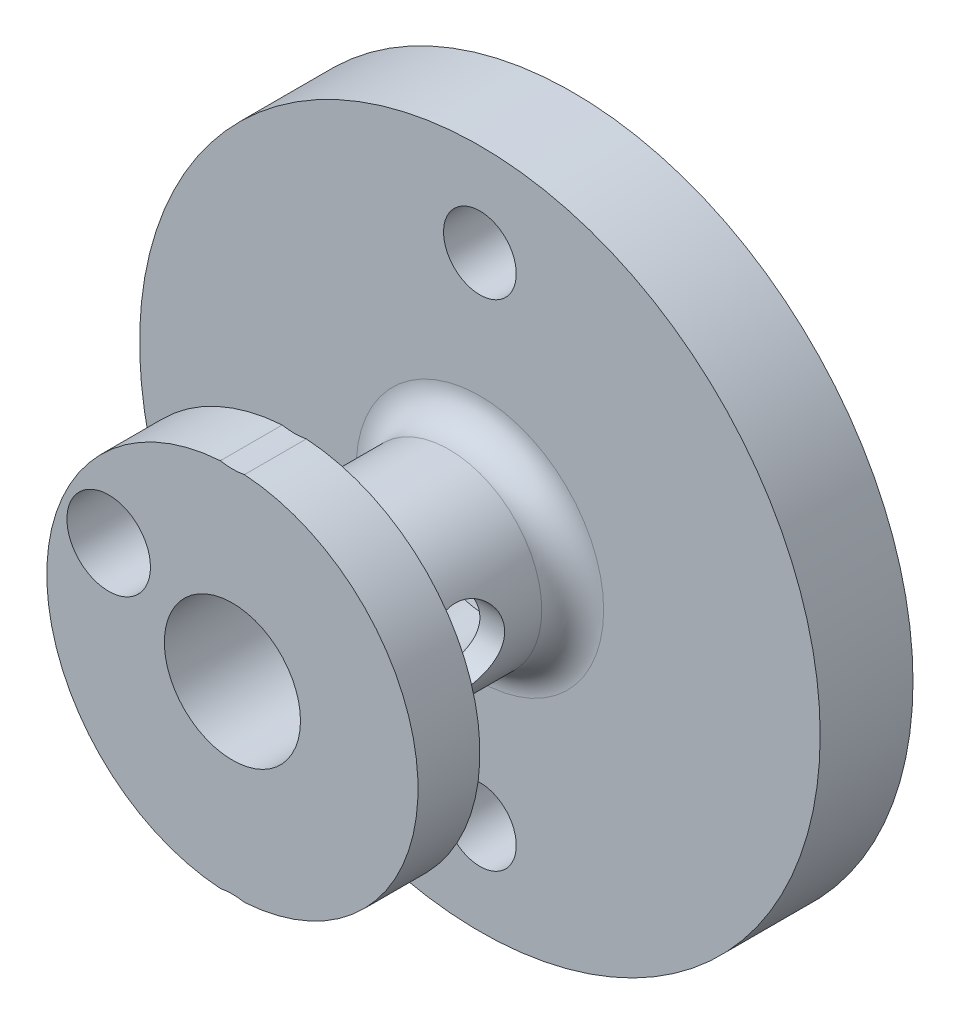
ISO-10303-21;
HEADER;
FILE_DESCRIPTION(('STEP AP214'),'2;1');
FILE_NAME('part.step','',(''),(''),'','','');
FILE_SCHEMA(('AUTOMOTIVE_DESIGN { 1 0 10303 214 1 1 1 1 }'));
ENDSEC;
DATA;
#1=APPLICATION_CONTEXT('core data for automotive mechanical design processes');
#2=APPLICATION_PROTOCOL_DEFINITION('international standard','automotive_design',2000,#1);
#3=PRODUCT_CONTEXT('',#1,'mechanical');
#4=PRODUCT('Part','Part','',(#3));
#5=PRODUCT_RELATED_PRODUCT_CATEGORY('part','',(#4));
#6=PRODUCT_DEFINITION_FORMATION('','',#4);
#7=PRODUCT_DEFINITION_CONTEXT('part definition',#1,'design');
#8=PRODUCT_DEFINITION('design','',#6,#7);
#9=PRODUCT_DEFINITION_SHAPE('','',#8);
#10=(LENGTH_UNIT() NAMED_UNIT(*) SI_UNIT(.MILLI.,.METRE.));
#11=(NAMED_UNIT(*) PLANE_ANGLE_UNIT() SI_UNIT($,.RADIAN.));
#12=(NAMED_UNIT(*) SI_UNIT($,.STERADIAN.) SOLID_ANGLE_UNIT());
#13=UNCERTAINTY_MEASURE_WITH_UNIT(LENGTH_MEASURE(1.E-05),#10,'distance_accuracy_value','');
#14=(GEOMETRIC_REPRESENTATION_CONTEXT(3) GLOBAL_UNCERTAINTY_ASSIGNED_CONTEXT((#13)) GLOBAL_UNIT_ASSIGNED_CONTEXT((#10,
#11,#12)) REPRESENTATION_CONTEXT('',''));
#15=CARTESIAN_POINT('',(0.,0.,0.));
#16=DIRECTION('',(0.,0.,1.));
#17=DIRECTION('',(1.,0.,0.));
#18=AXIS2_PLACEMENT_3D('',#15,#16,#17);
#19=CARTESIAN_POINT('',(0.,0.,5.5));
#20=DIRECTION('',(0.,0.,1.));
#21=DIRECTION('',(1.,0.,0.));
#22=AXIS2_PLACEMENT_3D('',#19,#20,#21);
#23=PLANE('',#22);
#24=CARTESIAN_POINT('',(-3.99938650861031,1.87703448918342,5.5));
#25=DIRECTION('',(0.,0.,1.));
#26=DIRECTION('',(1.,0.,0.));
#27=AXIS2_PLACEMENT_3D('',#24,#25,#26);
#28=CIRCLE('',#27,1.35);
#29=CARTESIAN_POINT('',(-2.64938650861031,1.87703448918342,5.5));
#30=VERTEX_POINT('',#29);
#31=EDGE_CURVE('E178',#30,#30,#28,.T.);
#32=ORIENTED_EDGE('',*,*,#31,.F.);
#33=EDGE_LOOP('',(#32));
#34=FACE_BOUND('',#33,.T.);
#35=CARTESIAN_POINT('',(0.,0.,5.5));
#36=DIRECTION('',(0.,0.,1.));
#37=DIRECTION('',(1.,0.,0.));
#38=AXIS2_PLACEMENT_3D('',#35,#36,#37);
#39=CIRCLE('',#38,2.2);
#40=CARTESIAN_POINT('',(2.2,0.,5.5));
#41=VERTEX_POINT('',#40);
#42=EDGE_CURVE('E123',#41,#41,#39,.T.);
#43=ORIENTED_EDGE('',*,*,#42,.F.);
#44=EDGE_LOOP('',(#43));
#45=FACE_BOUND('',#44,.T.);
#46=CARTESIAN_POINT('',(0.,-8.,5.5));
#47=DIRECTION('',(0.,0.,1.));
#48=DIRECTION('',(-1.,0.,0.));
#49=AXIS2_PLACEMENT_3D('',#46,#47,#48);
#50=CIRCLE('',#49,2.05);
#51=CARTESIAN_POINT('',(0.389505865598918,-5.98734375,5.5));
#52=VERTEX_POINT('',#51);
#53=CARTESIAN_POINT('',(-0.389505865598873,-5.98734375,5.5));
#54=VERTEX_POINT('',#53);
#55=EDGE_CURVE('E115',#52,#54,#50,.T.);
#56=ORIENTED_EDGE('',*,*,#55,.F.);
#57=CARTESIAN_POINT('',(0.,0.,5.5));
#58=DIRECTION('',(0.,0.,1.));
#59=DIRECTION('',(1.,0.,0.));
#60=AXIS2_PLACEMENT_3D('',#57,#58,#59);
#61=CIRCLE('',#60,6.);
#62=CARTESIAN_POINT('',(0.389505865598915,5.98734375,5.5));
#63=VERTEX_POINT('',#62);
#64=EDGE_CURVE('E245',#52,#63,#61,.T.);
#65=ORIENTED_EDGE('',*,*,#64,.T.);
#66=CARTESIAN_POINT('',(0.,8.,5.5));
#67=DIRECTION('',(0.,0.,1.));
#68=DIRECTION('',(1.,0.,0.));
#69=AXIS2_PLACEMENT_3D('',#66,#67,#68);
#70=CIRCLE('',#69,2.05);
#71=CARTESIAN_POINT('',(-0.389505865598874,5.98734375,5.5));
#72=VERTEX_POINT('',#71);
#73=EDGE_CURVE('E97',#72,#63,#70,.T.);
#74=ORIENTED_EDGE('',*,*,#73,.F.);
#75=EDGE_CURVE('E88',#72,#54,#61,.T.);
#76=ORIENTED_EDGE('',*,*,#75,.T.);
#77=EDGE_LOOP('',(#56,#65,#74,#76));
#78=FACE_BOUND('',#77,.T.);
#79=ADVANCED_FACE('F39',(#34,#45,#78),#23,.T.);
#80=CARTESIAN_POINT('',(0.,-8.,-4.29827560572969));
#81=DIRECTION('',(0.,0.,1.));
#82=DIRECTION('',(1.,0.,0.));
#83=AXIS2_PLACEMENT_3D('',#80,#81,#82);
#84=CYLINDRICAL_SURFACE('',#83,2.05);
#85=DIRECTION('',(0.,0.,1.));
#86=VECTOR('',#85,1.);
#87=CARTESIAN_POINT('',(0.389505865598918,-5.98734375,4.5));
#88=LINE('',#87,#86);
#89=CARTESIAN_POINT('',(0.389505865598917,-5.98734375,3.5));
#90=VERTEX_POINT('',#89);
#91=EDGE_CURVE('E56',#90,#52,#88,.T.);
#92=ORIENTED_EDGE('',*,*,#91,.T.);
#93=ORIENTED_EDGE('',*,*,#55,.T.);
#94=DIRECTION('',(0.,0.,1.));
#95=VECTOR('',#94,1.);
#96=CARTESIAN_POINT('',(-0.389505865598872,-5.98734375,4.5));
#97=LINE('',#96,#95);
#98=CARTESIAN_POINT('',(-0.38950586559887,-5.98734375,3.5));
#99=VERTEX_POINT('',#98);
#100=EDGE_CURVE('E248',#54,#99,#97,.F.);
#101=ORIENTED_EDGE('',*,*,#100,.T.);
#102=CARTESIAN_POINT('',(0.,-8.,3.5));
#103=DIRECTION('',(0.,0.,1.));
#104=DIRECTION('',(1.,0.,0.));
#105=AXIS2_PLACEMENT_3D('',#102,#103,#104);
#106=CIRCLE('',#105,2.05);
#107=EDGE_CURVE('E100',#99,#90,#106,.F.);
#108=ORIENTED_EDGE('',*,*,#107,.T.);
#109=EDGE_LOOP('',(#92,#93,#101,#108));
#110=FACE_BOUND('',#109,.T.);
#111=ADVANCED_FACE('F200',(#110),#84,.F.);
#112=CARTESIAN_POINT('',(0.,8.,-4.29827560572969));
#113=DIRECTION('',(0.,0.,1.));
#114=DIRECTION('',(1.,0.,0.));
#115=AXIS2_PLACEMENT_3D('',#112,#113,#114);
#116=CYLINDRICAL_SURFACE('',#115,2.05);
#117=DIRECTION('',(0.,0.,1.));
#118=VECTOR('',#117,1.);
#119=CARTESIAN_POINT('',(0.389505865598915,5.98734375,4.5));
#120=LINE('',#119,#118);
#121=CARTESIAN_POINT('',(0.389505865598901,5.98734375,3.5));
#122=VERTEX_POINT('',#121);
#123=EDGE_CURVE('E82',#63,#122,#120,.F.);
#124=ORIENTED_EDGE('',*,*,#123,.T.);
#125=CARTESIAN_POINT('',(0.,8.,3.5));
#126=DIRECTION('',(0.,0.,1.));
#127=DIRECTION('',(1.,0.,0.));
#128=AXIS2_PLACEMENT_3D('',#125,#126,#127);
#129=CIRCLE('',#128,2.05);
#130=CARTESIAN_POINT('',(-0.389505865598867,5.98734375,3.5));
#131=VERTEX_POINT('',#130);
#132=EDGE_CURVE('E95',#122,#131,#129,.F.);
#133=ORIENTED_EDGE('',*,*,#132,.T.);
#134=DIRECTION('',(0.,0.,1.));
#135=VECTOR('',#134,1.);
#136=CARTESIAN_POINT('',(-0.389505865598874,5.98734375,4.5));
#137=LINE('',#136,#135);
#138=EDGE_CURVE('E64',#131,#72,#137,.T.);
#139=ORIENTED_EDGE('',*,*,#138,.T.);
#140=ORIENTED_EDGE('',*,*,#73,.T.);
#141=EDGE_LOOP('',(#124,#133,#139,#140));
#142=FACE_BOUND('',#141,.T.);
#143=ADVANCED_FACE('F94',(#142),#116,.F.);
#144=CARTESIAN_POINT('',(0.,0.,3.5));
#145=DIRECTION('',(0.,0.,1.));
#146=DIRECTION('',(1.,0.,0.));
#147=AXIS2_PLACEMENT_3D('',#144,#145,#146);
#148=PLANE('',#147);
#149=CARTESIAN_POINT('',(-3.99938650861031,1.87703448918342,3.5));
#150=DIRECTION('',(0.,0.,1.));
#151=DIRECTION('',(1.,0.,0.));
#152=AXIS2_PLACEMENT_3D('',#149,#150,#151);
#153=CIRCLE('',#152,1.35);
#154=CARTESIAN_POINT('',(-2.64938650861031,1.87703448918342,3.5));
#155=VERTEX_POINT('',#154);
#156=EDGE_CURVE('E43',#155,#155,#153,.T.);
#157=ORIENTED_EDGE('',*,*,#156,.T.);
#158=EDGE_LOOP('',(#157));
#159=FACE_BOUND('',#158,.T.);
#160=CARTESIAN_POINT('',(0.,0.,3.5));
#161=DIRECTION('',(0.,0.,1.));
#162=DIRECTION('',(1.,0.,0.));
#163=AXIS2_PLACEMENT_3D('',#160,#161,#162);
#164=CIRCLE('',#163,3.);
#165=CARTESIAN_POINT('',(3.,0.,3.5));
#166=VERTEX_POINT('',#165);
#167=EDGE_CURVE('E106',#166,#166,#164,.T.);
#168=ORIENTED_EDGE('',*,*,#167,.T.);
#169=EDGE_LOOP('',(#168));
#170=FACE_BOUND('',#169,.T.);
#171=CARTESIAN_POINT('',(0.,0.,3.5));
#172=DIRECTION('',(0.,0.,1.));
#173=DIRECTION('',(1.,0.,0.));
#174=AXIS2_PLACEMENT_3D('',#171,#172,#173);
#175=CIRCLE('',#174,6.);
#176=EDGE_CURVE('E79',#122,#90,#175,.F.);
#177=ORIENTED_EDGE('',*,*,#176,.T.);
#178=ORIENTED_EDGE('',*,*,#107,.F.);
#179=EDGE_CURVE('E90',#99,#131,#175,.F.);
#180=ORIENTED_EDGE('',*,*,#179,.T.);
#181=ORIENTED_EDGE('',*,*,#132,.F.);
#182=EDGE_LOOP('',(#177,#178,#180,#181));
#183=FACE_BOUND('',#182,.T.);
#184=ADVANCED_FACE('F99',(#159,#170,#183),#148,.F.);
#185=CARTESIAN_POINT('',(0.,8.,-5.5));
#186=DIRECTION('',(0.,0.,1.));
#187=DIRECTION('',(1.,0.,0.));
#188=AXIS2_PLACEMENT_3D('',#185,#186,#187);
#189=CYLINDRICAL_SURFACE('',#188,1.175);
#190=CARTESIAN_POINT('',(0.,8.,-5.5));
#191=DIRECTION('',(0.,0.,1.));
#192=DIRECTION('',(1.,0.,0.));
#193=AXIS2_PLACEMENT_3D('',#190,#191,#192);
#194=CIRCLE('',#193,1.175);
#195=CARTESIAN_POINT('',(1.17499999999997,8.,-5.5));
#196=VERTEX_POINT('',#195);
#197=EDGE_CURVE('E118',#196,#196,#194,.T.);
#198=ORIENTED_EDGE('',*,*,#197,.F.);
#199=EDGE_LOOP('',(#198));
#200=FACE_BOUND('',#199,.T.);
#201=CARTESIAN_POINT('',(0.,8.,-2.5));
#202=DIRECTION('',(0.,0.,1.));
#203=DIRECTION('',(1.,0.,0.));
#204=AXIS2_PLACEMENT_3D('',#201,#202,#203);
#205=CIRCLE('',#204,1.175);
#206=CARTESIAN_POINT('',(1.17499999999997,8.,-2.5));
#207=VERTEX_POINT('',#206);
#208=EDGE_CURVE('E112',#207,#207,#205,.F.);
#209=ORIENTED_EDGE('',*,*,#208,.F.);
#210=EDGE_LOOP('',(#209));
#211=FACE_BOUND('',#210,.T.);
#212=ADVANCED_FACE('F210',(#200,#211),#189,.F.);
#213=CARTESIAN_POINT('',(0.,-8.,-5.5));
#214=DIRECTION('',(0.,0.,1.));
#215=DIRECTION('',(1.,0.,0.));
#216=AXIS2_PLACEMENT_3D('',#213,#214,#215);
#217=CYLINDRICAL_SURFACE('',#216,1.175);
#218=CARTESIAN_POINT('',(0.,-8.,-5.5));
#219=DIRECTION('',(0.,0.,1.));
#220=DIRECTION('',(-1.,0.,0.));
#221=AXIS2_PLACEMENT_3D('',#218,#219,#220);
#222=CIRCLE('',#221,1.175);
#223=CARTESIAN_POINT('',(-1.17500000000003,-8.,-5.5));
#224=VERTEX_POINT('',#223);
#225=EDGE_CURVE('E120',#224,#224,#222,.T.);
#226=ORIENTED_EDGE('',*,*,#225,.F.);
#227=EDGE_LOOP('',(#226));
#228=FACE_BOUND('',#227,.T.);
#229=CARTESIAN_POINT('',(0.,-8.,-2.5));
#230=DIRECTION('',(0.,0.,1.));
#231=DIRECTION('',(1.,0.,0.));
#232=AXIS2_PLACEMENT_3D('',#229,#230,#231);
#233=CIRCLE('',#232,1.175);
#234=CARTESIAN_POINT('',(1.17499999999997,-8.,-2.5));
#235=VERTEX_POINT('',#234);
#236=EDGE_CURVE('E103',#235,#235,#233,.F.);
#237=ORIENTED_EDGE('',*,*,#236,.F.);
#238=EDGE_LOOP('',(#237));
#239=FACE_BOUND('',#238,.T.);
#240=ADVANCED_FACE('F205',(#228,#239),#217,.F.);
#241=CARTESIAN_POINT('',(0.,0.,5.5));
#242=DIRECTION('',(0.,0.,-1.));
#243=DIRECTION('',(-1.,0.,0.));
#244=AXIS2_PLACEMENT_3D('',#241,#242,#243);
#245=CYLINDRICAL_SURFACE('',#244,11.);
#246=CARTESIAN_POINT('',(0.,0.,-5.5));
#247=DIRECTION('',(0.,0.,1.));
#248=DIRECTION('',(1.,0.,0.));
#249=AXIS2_PLACEMENT_3D('',#246,#247,#248);
#250=CIRCLE('',#249,11.);
#251=CARTESIAN_POINT('',(11.,0.,-5.5));
#252=VERTEX_POINT('',#251);
#253=EDGE_CURVE('E137',#252,#252,#250,.T.);
#254=ORIENTED_EDGE('',*,*,#253,.T.);
#255=EDGE_LOOP('',(#254));
#256=FACE_BOUND('',#255,.T.);
#257=CARTESIAN_POINT('',(0.,0.,-2.5));
#258=DIRECTION('',(0.,0.,1.));
#259=DIRECTION('',(1.,0.,0.));
#260=AXIS2_PLACEMENT_3D('',#257,#258,#259);
#261=CIRCLE('',#260,11.);
#262=CARTESIAN_POINT('',(11.,0.,-2.5));
#263=VERTEX_POINT('',#262);
#264=EDGE_CURVE('E101',#263,#263,#261,.T.);
#265=ORIENTED_EDGE('',*,*,#264,.F.);
#266=EDGE_LOOP('',(#265));
#267=FACE_BOUND('',#266,.T.);
#268=ADVANCED_FACE('F196',(#256,#267),#245,.T.);
#269=CARTESIAN_POINT('',(0.,0.,5.5));
#270=DIRECTION('',(0.,0.,-1.));
#271=DIRECTION('',(-1.,0.,0.));
#272=AXIS2_PLACEMENT_3D('',#269,#270,#271);
#273=CYLINDRICAL_SURFACE('',#272,4.175);
#274=CARTESIAN_POINT('',(0.,0.,-5.5));
#275=DIRECTION('',(0.,0.,1.));
#276=DIRECTION('',(1.,0.,0.));
#277=AXIS2_PLACEMENT_3D('',#274,#275,#276);
#278=CIRCLE('',#277,4.175);
#279=CARTESIAN_POINT('',(4.175,0.,-5.5));
#280=VERTEX_POINT('',#279);
#281=EDGE_CURVE('E134',#280,#280,#278,.T.);
#282=ORIENTED_EDGE('',*,*,#281,.F.);
#283=EDGE_LOOP('',(#282));
#284=FACE_BOUND('',#283,.T.);
#285=CARTESIAN_POINT('',(0.,0.,-2.65));
#286=DIRECTION('',(0.,0.,1.));
#287=DIRECTION('',(1.,0.,0.));
#288=AXIS2_PLACEMENT_3D('',#285,#286,#287);
#289=CIRCLE('',#288,4.175);
#290=CARTESIAN_POINT('',(4.175,0.,-2.65));
#291=VERTEX_POINT('',#290);
#292=EDGE_CURVE('E126',#291,#291,#289,.F.);
#293=ORIENTED_EDGE('',*,*,#292,.F.);
#294=EDGE_LOOP('',(#293));
#295=FACE_BOUND('',#294,.T.);
#296=ADVANCED_FACE('F192',(#284,#295),#273,.F.);
#297=CARTESIAN_POINT('',(0.,0.,-5.5));
#298=DIRECTION('',(0.,0.,1.));
#299=DIRECTION('',(1.,0.,0.));
#300=AXIS2_PLACEMENT_3D('',#297,#298,#299);
#301=PLANE('',#300);
#302=ORIENTED_EDGE('',*,*,#225,.T.);
#303=EDGE_LOOP('',(#302));
#304=FACE_BOUND('',#303,.T.);
#305=ORIENTED_EDGE('',*,*,#197,.T.);
#306=EDGE_LOOP('',(#305));
#307=FACE_BOUND('',#306,.T.);
#308=ORIENTED_EDGE('',*,*,#253,.F.);
#309=EDGE_LOOP('',(#308));
#310=FACE_BOUND('',#309,.T.);
#311=ORIENTED_EDGE('',*,*,#281,.T.);
#312=EDGE_LOOP('',(#311));
#313=FACE_BOUND('',#312,.T.);
#314=ADVANCED_FACE('F189',(#304,#307,#310,#313),#301,.F.);
#315=CARTESIAN_POINT('',(0.,0.,-17.3086832458153));
#316=DIRECTION('',(0.,0.,1.));
#317=DIRECTION('',(1.,0.,0.));
#318=AXIS2_PLACEMENT_3D('',#315,#316,#317);
#319=CYLINDRICAL_SURFACE('',#318,2.2);
#320=CARTESIAN_POINT('',(2.2,0.,-0.299999999999999));
#321=CARTESIAN_POINT('',(2.19999207054138,0.0666676406194159,-0.299990959096874));
#322=CARTESIAN_POINT('',(2.19693546803973,0.133438384522522,-0.294834930566221));
#323=CARTESIAN_POINT('',(2.18498806422547,0.264991401069785,-0.274455597835902));
#324=CARTESIAN_POINT('',(2.17608179088393,0.32976792213293,-0.259205594846164));
#325=CARTESIAN_POINT('',(2.15334473887417,0.455130815280899,-0.219490450811456));
#326=CARTESIAN_POINT('',(2.13953834790796,0.515736194867806,-0.195070911910637));
#327=CARTESIAN_POINT('',(2.10818436590145,0.631805413625118,-0.137984649744263));
#328=CARTESIAN_POINT('',(2.09063789501846,0.687270785112086,-0.105320395240189));
#329=CARTESIAN_POINT('',(2.05174185420155,0.79620737091969,-0.0299350360781591));
#330=CARTESIAN_POINT('',(2.03020554665121,0.849215226967981,0.0133574959913744));
#331=CARTESIAN_POINT('',(1.98616124934465,0.947670350649213,0.107493165542234));
#332=CARTESIAN_POINT('',(1.96365206260597,0.993107950289762,0.158345803657553));
#333=CARTESIAN_POINT('',(1.91705611150813,1.08056842032924,0.27323727898426));
#334=CARTESIAN_POINT('',(1.89309694731521,1.12155440632114,0.338124121827653));
#335=CARTESIAN_POINT('',(1.84963346918371,1.19187789284511,0.475271030891254));
#336=CARTESIAN_POINT('',(1.83012207864704,1.22123395279156,0.54751911622828));
#337=CARTESIAN_POINT('',(1.80256737396389,1.26142751642414,0.679997024853756));
#338=CARTESIAN_POINT('',(1.79290652563528,1.27499580086068,0.739060735206791));
#339=CARTESIAN_POINT('',(1.7794109521006,1.29376807013469,0.859128118780174));
#340=CARTESIAN_POINT('',(1.77556931751421,1.2989819748803,0.920129403398726));
#341=CARTESIAN_POINT('',(1.77427596170078,1.30074849111555,1.0424337587181));
#342=CARTESIAN_POINT('',(1.77683545868015,1.29728589671711,1.10373717105944));
#343=CARTESIAN_POINT('',(1.78797663918448,1.28188348510395,1.224721817934));
#344=CARTESIAN_POINT('',(1.79656273258589,1.26993746018404,1.2844018313298));
#345=CARTESIAN_POINT('',(1.81847698794388,1.23834640820778,1.40007774684973));
#346=CARTESIAN_POINT('',(1.83175791590859,1.21877787706616,1.4561039893829));
#347=CARTESIAN_POINT('',(1.86162684430655,1.17264617904104,1.56423467358822));
#348=CARTESIAN_POINT('',(1.87821607381383,1.14608041141948,1.61633764777878));
#349=CARTESIAN_POINT('',(1.91624826851977,1.08149088418267,1.72456651568071));
#350=CARTESIAN_POINT('',(1.93803673117015,1.04228637790408,1.77986691031144));
#351=CARTESIAN_POINT('',(1.98208257694595,0.955878936052174,1.88366408936472));
#352=CARTESIAN_POINT('',(2.00434037697884,0.908668602206769,1.93215450414194));
#353=CARTESIAN_POINT('',(2.05025256755707,0.800227847895981,2.0273736089175));
#354=CARTESIAN_POINT('',(2.07370869719233,0.737971254103755,2.07304182205294));
#355=CARTESIAN_POINT('',(2.11625479280326,0.605236088596787,2.15311945853167));
#356=CARTESIAN_POINT('',(2.13534725483987,0.534762252243904,2.18753532320462));
#357=CARTESIAN_POINT('',(2.16589297929643,0.392252910088738,2.24159413399482));
#358=CARTESIAN_POINT('',(2.17776433909681,0.320621290893817,2.26205633693309));
#359=CARTESIAN_POINT('',(2.19433084693023,0.17413494438726,2.29043583801351));
#360=CARTESIAN_POINT('',(2.19903408630642,0.0992839494148635,2.29836728119372));
#361=CARTESIAN_POINT('',(2.20058855527366,-0.0408618215152228,2.30099433789556));
#362=CARTESIAN_POINT('',(2.19838867143402,-0.106122445428176,2.29728939482577));
#363=CARTESIAN_POINT('',(2.18837414265119,-0.234923025503808,2.28024585942024));
#364=CARTESIAN_POINT('',(2.18055953548451,-0.298462993240275,2.26690733190036));
#365=CARTESIAN_POINT('',(2.16023867418258,-0.420892369211056,2.23159807036659));
#366=CARTESIAN_POINT('',(2.14782698426996,-0.479848348170182,2.20980092979584));
#367=CARTESIAN_POINT('',(2.11930493759046,-0.59327101306416,2.1584082750803));
#368=CARTESIAN_POINT('',(2.10319380355025,-0.647736752302336,2.12881112191715));
#369=CARTESIAN_POINT('',(2.06662869214539,-0.756760545871858,2.05920821664161));
#370=CARTESIAN_POINT('',(2.04589714123413,-0.810737099420629,2.0184393377061));
#371=CARTESIAN_POINT('',(2.00304210910472,-0.911497194792972,1.92935660906864));
#372=CARTESIAN_POINT('',(1.98091702231724,-0.958272217533851,1.88103395766779));
#373=CARTESIAN_POINT('',(1.93440962023599,-1.04927658874178,1.7711821850457));
#374=CARTESIAN_POINT('',(1.91008919406189,-1.09246410849482,1.70875788245693));
#375=CARTESIAN_POINT('',(1.86503336083285,-1.16772386873352,1.57636870376567));
#376=CARTESIAN_POINT('',(1.84429381647214,-1.19980898044587,1.50641268357732));
#377=CARTESIAN_POINT('',(1.81340540316407,-1.24585645914238,1.37619757974048));
#378=CARTESIAN_POINT('',(1.80193643637184,-1.26223673186933,1.31710954109999));
#379=CARTESIAN_POINT('',(1.78466864316823,-1.28654022738094,1.19644282977797));
#380=CARTESIAN_POINT('',(1.77886238916541,-1.29447452971686,1.13486753032326));
#381=CARTESIAN_POINT('',(1.77377059629644,-1.30144513174823,1.01073858103116));
#382=CARTESIAN_POINT('',(1.77450560183705,-1.30045339695593,0.948182465188568));
#383=CARTESIAN_POINT('',(1.78242925723215,-1.28956868862758,0.824253036492817));
#384=CARTESIAN_POINT('',(1.78962168564182,-1.27967050348259,0.76288043765431));
#385=CARTESIAN_POINT('',(1.80902445577651,-1.25207728936355,0.645293548795057));
#386=CARTESIAN_POINT('',(1.82103570790788,-1.2346897959472,0.58897204841263));
#387=CARTESIAN_POINT('',(1.84868806447735,-1.19288665757497,0.479968036568864));
#388=CARTESIAN_POINT('',(1.86433053113337,-1.16846837425235,0.427286900406237));
#389=CARTESIAN_POINT('',(1.90042550287465,-1.10895034789732,0.318343280844619));
#390=CARTESIAN_POINT('',(1.92124776376663,-1.07278254072729,0.262787625780997));
#391=CARTESIAN_POINT('',(1.96384576882726,-0.99265887668983,0.157987324134176));
#392=CARTESIAN_POINT('',(1.98562227126727,-0.948696738497656,0.108747823213405));
#393=CARTESIAN_POINT('',(2.0315426001311,-0.846420781627337,0.0103877273485571));
#394=CARTESIAN_POINT('',(2.0555490612784,-0.786942680868622,-0.0375982429848808));
#395=CARTESIAN_POINT('',(2.09991130611992,-0.659483653969446,-0.122922725030188));
#396=CARTESIAN_POINT('',(2.12026604831786,-0.591500311427348,-0.160258200930988));
#397=CARTESIAN_POINT('',(2.15432064139405,-0.451532384940737,-0.22135732816277));
#398=CARTESIAN_POINT('',(2.16825537153425,-0.379818980371636,-0.245606750867535));
#399=CARTESIAN_POINT('',(2.18893910705675,-0.232436394505546,-0.281277429434407));
#400=CARTESIAN_POINT('',(2.19571562667791,-0.156783541428364,-0.292747813859403));
#401=CARTESIAN_POINT('',(2.19950880653269,-0.0538510747089307,-0.299167220358755));
#402=CARTESIAN_POINT('',(2.20000320352801,-0.0269339515476565,-0.300003652555338));
#403=CARTESIAN_POINT('',(2.2,0.,-0.299999999999999));
#404=B_SPLINE_CURVE_WITH_KNOTS('',3,(#320,#321,#322,#323,#324,#325,#326,#327,#328,#329,#330,
#331,#332,#333,#334,#335,#336,#337,#338,#339,#340,#341,#342,#343,#344,#345,#346,#347,#348,#349,
#350,#351,#352,#353,#354,#355,#356,#357,#358,#359,#360,#361,#362,#363,#364,#365,#366,#367,#368,
#369,#370,#371,#372,#373,#374,#375,#376,#377,#378,#379,#380,#381,#382,#383,#384,#385,#386,#387,
#388,#389,#390,#391,#392,#393,#394,#395,#396,#397,#398,#399,#400,#401,#402,#403),.UNSPECIFIED.,
.T.,.F.,(4,2,2,2,2,2,2,2,2,2,2,2,2,2,2,2,2,2,2,2,2,2,2,2,2,2,2,2,2,2,2,2,2,2,2,2,2,2,2,2,2,4),
(0.,0.199921805276104,0.400374532739358,0.599843290578083,0.799252391076635,1.01365201528485,
1.22832338506734,1.46834530344522,1.70798262903172,1.89129967817351,2.07439889672357,
2.25781922782607,2.44137391426375,2.62313211566577,2.80495796865542,3.01774223327652,
3.23072421653316,3.47157070287528,3.71227907592018,3.93723785327297,4.16194250957202,
4.35717739736431,4.55241097160611,4.74383336490379,4.93529601394744,5.14670482964617,
5.3583618419615,5.59636817954988,5.8340976602141,6.0204577113495,6.20657299014692,
6.39327301475257,6.58008235796299,6.75985934659504,6.93970388626957,7.14737169214048,
7.35520762119154,7.59434291494556,7.83354630373798,8.06312195445877,8.29181193087571,
8.37258101414604),.UNSPECIFIED.);
#405=CARTESIAN_POINT('',(2.2,0.,-0.299999999999999));
#406=VERTEX_POINT('',#405);
#407=EDGE_CURVE('E177',#406,#406,#404,.T.);
#408=ORIENTED_EDGE('',*,*,#407,.T.);
#409=EDGE_LOOP('',(#408));
#410=FACE_BOUND('',#409,.T.);
#411=CARTESIAN_POINT('',(-2.2,0.,-0.3));
#412=CARTESIAN_POINT('',(-2.19999207054138,-0.0666676406194159,-0.299990959096876));
#413=CARTESIAN_POINT('',(-2.19693546803973,-0.133438384522522,-0.294834930566222));
#414=CARTESIAN_POINT('',(-2.18498806422547,-0.264991401069785,-0.274455597835902));
#415=CARTESIAN_POINT('',(-2.17608179088393,-0.32976792213293,-0.259205594846164));
#416=CARTESIAN_POINT('',(-2.15334473887417,-0.4551308152809,-0.219490450811456));
#417=CARTESIAN_POINT('',(-2.13953834790796,-0.515736194867806,-0.195070911910637));
#418=CARTESIAN_POINT('',(-2.10818436590145,-0.631805413625119,-0.137984649744263));
#419=CARTESIAN_POINT('',(-2.09063789501846,-0.687270785112086,-0.105320395240189));
#420=CARTESIAN_POINT('',(-2.05174185420155,-0.796207370919691,-0.0299350360781589));
#421=CARTESIAN_POINT('',(-2.03020554665121,-0.849215226967982,0.0133574959913746));
#422=CARTESIAN_POINT('',(-1.98616124934465,-0.947670350649213,0.107493165542234));
#423=CARTESIAN_POINT('',(-1.96365206260597,-0.993107950289762,0.158345803657553));
#424=CARTESIAN_POINT('',(-1.91705611150813,-1.08056842032924,0.27323727898426));
#425=CARTESIAN_POINT('',(-1.89309694731521,-1.12155440632114,0.338124121827653));
#426=CARTESIAN_POINT('',(-1.84963346918371,-1.19187789284511,0.475271030891254));
#427=CARTESIAN_POINT('',(-1.83012207864704,-1.22123395279156,0.54751911622828));
#428=CARTESIAN_POINT('',(-1.80256737396389,-1.26142751642414,0.679997024853757));
#429=CARTESIAN_POINT('',(-1.79290652563528,-1.27499580086068,0.739060735206791));
#430=CARTESIAN_POINT('',(-1.7794109521006,-1.29376807013469,0.859128118780175));
#431=CARTESIAN_POINT('',(-1.77556931751421,-1.2989819748803,0.920129403398726));
#432=CARTESIAN_POINT('',(-1.77427596170078,-1.30074849111555,1.0424337587181));
#433=CARTESIAN_POINT('',(-1.77683545868015,-1.29728589671711,1.10373717105944));
#434=CARTESIAN_POINT('',(-1.78797663918448,-1.28188348510395,1.224721817934));
#435=CARTESIAN_POINT('',(-1.79656273258589,-1.26993746018404,1.2844018313298));
#436=CARTESIAN_POINT('',(-1.81847698794388,-1.23834640820778,1.40007774684973));
#437=CARTESIAN_POINT('',(-1.83175791590859,-1.21877787706616,1.4561039893829));
#438=CARTESIAN_POINT('',(-1.86162684430655,-1.17264617904104,1.56423467358822));
#439=CARTESIAN_POINT('',(-1.87821607381383,-1.14608041141948,1.61633764777878));
#440=CARTESIAN_POINT('',(-1.91624826851977,-1.08149088418266,1.72456651568071));
#441=CARTESIAN_POINT('',(-1.93803673117015,-1.04228637790407,1.77986691031144));
#442=CARTESIAN_POINT('',(-1.98208257694596,-0.955878936052173,1.88366408936472));
#443=CARTESIAN_POINT('',(-2.00434037697884,-0.908668602206768,1.93215450414194));
#444=CARTESIAN_POINT('',(-2.05025256755707,-0.80022784789598,2.0273736089175));
#445=CARTESIAN_POINT('',(-2.07370869719233,-0.737971254103754,2.07304182205294));
#446=CARTESIAN_POINT('',(-2.11625479280326,-0.605236088596786,2.15311945853167));
#447=CARTESIAN_POINT('',(-2.13534725483987,-0.534762252243903,2.18753532320462));
#448=CARTESIAN_POINT('',(-2.16589297929643,-0.392252910088737,2.24159413399482));
#449=CARTESIAN_POINT('',(-2.17776433909681,-0.320621290893817,2.26205633693309));
#450=CARTESIAN_POINT('',(-2.19433084693023,-0.17413494438726,2.29043583801351));
#451=CARTESIAN_POINT('',(-2.19903408630642,-0.099283949414863,2.29836728119372));
#452=CARTESIAN_POINT('',(-2.20058855527366,0.040861821515224,2.30099433789556));
#453=CARTESIAN_POINT('',(-2.19838867143402,0.106122445428177,2.29728939482577));
#454=CARTESIAN_POINT('',(-2.18837414265119,0.23492302550381,2.28024585942024));
#455=CARTESIAN_POINT('',(-2.18055953548451,0.298462993240276,2.26690733190036));
#456=CARTESIAN_POINT('',(-2.16023867418258,0.420892369211057,2.23159807036659));
#457=CARTESIAN_POINT('',(-2.14782698426996,0.479848348170183,2.20980092979584));
#458=CARTESIAN_POINT('',(-2.11930493759046,0.593271013064161,2.1584082750803));
#459=CARTESIAN_POINT('',(-2.10319380355025,0.647736752302336,2.12881112191715));
#460=CARTESIAN_POINT('',(-2.06662869214539,0.756760545871859,2.05920821664161));
#461=CARTESIAN_POINT('',(-2.04589714123413,0.810737099420629,2.0184393377061));
#462=CARTESIAN_POINT('',(-2.00304210910472,0.911497194792972,1.92935660906864));
#463=CARTESIAN_POINT('',(-1.98091702231724,0.958272217533851,1.88103395766779));
#464=CARTESIAN_POINT('',(-1.93440962023599,1.04927658874178,1.7711821850457));
#465=CARTESIAN_POINT('',(-1.91008919406189,1.09246410849482,1.70875788245693));
#466=CARTESIAN_POINT('',(-1.86503336083285,1.16772386873352,1.57636870376567));
#467=CARTESIAN_POINT('',(-1.84429381647214,1.19980898044587,1.50641268357732));
#468=CARTESIAN_POINT('',(-1.81340540316407,1.24585645914238,1.37619757974048));
#469=CARTESIAN_POINT('',(-1.80193643637184,1.26223673186933,1.31710954109998));
#470=CARTESIAN_POINT('',(-1.78466864316823,1.28654022738094,1.19644282977796));
#471=CARTESIAN_POINT('',(-1.77886238916541,1.29447452971686,1.13486753032326));
#472=CARTESIAN_POINT('',(-1.77377059629644,1.30144513174823,1.01073858103116));
#473=CARTESIAN_POINT('',(-1.77450560183705,1.30045339695593,0.948182465188566));
#474=CARTESIAN_POINT('',(-1.78242925723215,1.28956868862758,0.824253036492816));
#475=CARTESIAN_POINT('',(-1.78962168564182,1.27967050348259,0.762880437654309));
#476=CARTESIAN_POINT('',(-1.80902445577651,1.25207728936355,0.645293548795055));
#477=CARTESIAN_POINT('',(-1.82103570790788,1.2346897959472,0.588972048412628));
#478=CARTESIAN_POINT('',(-1.84868806447735,1.19288665757497,0.479968036568862));
#479=CARTESIAN_POINT('',(-1.86433053113338,1.16846837425235,0.427286900406236));
#480=CARTESIAN_POINT('',(-1.90042550287465,1.10895034789731,0.318343280844617));
#481=CARTESIAN_POINT('',(-1.92124776376663,1.07278254072729,0.262787625780995));
#482=CARTESIAN_POINT('',(-1.96384576882726,0.992658876689829,0.157987324134174));
#483=CARTESIAN_POINT('',(-1.98562227126727,0.948696738497655,0.108747823213403));
#484=CARTESIAN_POINT('',(-2.0315426001311,0.846420781627336,0.0103877273485557));
#485=CARTESIAN_POINT('',(-2.0555490612784,0.786942680868621,-0.037598242984882));
#486=CARTESIAN_POINT('',(-2.09991130611992,0.659483653969445,-0.122922725030189));
#487=CARTESIAN_POINT('',(-2.12026604831786,0.591500311427346,-0.160258200930989));
#488=CARTESIAN_POINT('',(-2.15432064139405,0.451532384940735,-0.221357328162771));
#489=CARTESIAN_POINT('',(-2.16825537153425,0.379818980371635,-0.245606750867535));
#490=CARTESIAN_POINT('',(-2.18893910705675,0.232436394505544,-0.281277429434407));
#491=CARTESIAN_POINT('',(-2.19571562667791,0.156783541428362,-0.292747813859402));
#492=CARTESIAN_POINT('',(-2.19950880653269,0.0538510747089295,-0.299167220358755));
#493=CARTESIAN_POINT('',(-2.20000320352801,0.0269339515476559,-0.300003652555339));
#494=CARTESIAN_POINT('',(-2.2,0.,-0.3));
#495=B_SPLINE_CURVE_WITH_KNOTS('',3,(#411,#412,#413,#414,#415,#416,#417,#418,#419,#420,#421,
#422,#423,#424,#425,#426,#427,#428,#429,#430,#431,#432,#433,#434,#435,#436,#437,#438,#439,#440,
#441,#442,#443,#444,#445,#446,#447,#448,#449,#450,#451,#452,#453,#454,#455,#456,#457,#458,#459,
#460,#461,#462,#463,#464,#465,#466,#467,#468,#469,#470,#471,#472,#473,#474,#475,#476,#477,#478,
#479,#480,#481,#482,#483,#484,#485,#486,#487,#488,#489,#490,#491,#492,#493,#494),.UNSPECIFIED.,
.T.,.F.,(4,2,2,2,2,2,2,2,2,2,2,2,2,2,2,2,2,2,2,2,2,2,2,2,2,2,2,2,2,2,2,2,2,2,2,2,2,2,2,2,2,4),
(0.,0.199921805276104,0.400374532739359,0.599843290578084,0.799252391076636,1.01365201528485,
1.22832338506734,1.46834530344522,1.70798262903172,1.89129967817351,2.07439889672357,
2.25781922782607,2.44137391426375,2.62313211566577,2.80495796865542,3.01774223327652,
3.23072421653317,3.47157070287528,3.71227907592019,3.93723785327297,4.16194250957202,
4.35717739736431,4.55241097160611,4.74383336490379,4.93529601394745,5.14670482964617,
5.3583618419615,5.59636817954988,5.8340976602141,6.0204577113495,6.20657299014692,
6.39327301475257,6.58008235796299,6.75985934659505,6.93970388626957,7.14737169214049,
7.35520762119155,7.59434291494556,7.83354630373798,8.06312195445877,8.29181193087571,
8.37258101414604),.UNSPECIFIED.);
#496=CARTESIAN_POINT('',(-2.2,0.,-0.3));
#497=VERTEX_POINT('',#496);
#498=EDGE_CURVE('E170',#497,#497,#495,.T.);
#499=ORIENTED_EDGE('',*,*,#498,.T.);
#500=EDGE_LOOP('',(#499));
#501=FACE_BOUND('',#500,.T.);
#502=CARTESIAN_POINT('',(0.,0.,-2.65));
#503=DIRECTION('',(0.,0.,1.));
#504=DIRECTION('',(1.,0.,0.));
#505=AXIS2_PLACEMENT_3D('',#502,#503,#504);
#506=CIRCLE('',#505,2.2);
#507=CARTESIAN_POINT('',(2.2,0.,-2.65));
#508=VERTEX_POINT('',#507);
#509=EDGE_CURVE('E129',#508,#508,#506,.F.);
#510=ORIENTED_EDGE('',*,*,#509,.T.);
#511=EDGE_LOOP('',(#510));
#512=FACE_BOUND('',#511,.T.);
#513=ORIENTED_EDGE('',*,*,#42,.T.);
#514=EDGE_LOOP('',(#513));
#515=FACE_BOUND('',#514,.T.);
#516=ADVANCED_FACE('F183',(#410,#501,#512,#515),#319,.F.);
#517=CARTESIAN_POINT('',(0.,0.,-2.65));
#518=DIRECTION('',(0.,0.,1.));
#519=DIRECTION('',(1.,0.,0.));
#520=AXIS2_PLACEMENT_3D('',#517,#518,#519);
#521=PLANE('',#520);
#522=ORIENTED_EDGE('',*,*,#292,.T.);
#523=EDGE_LOOP('',(#522));
#524=FACE_BOUND('',#523,.T.);
#525=ORIENTED_EDGE('',*,*,#509,.F.);
#526=EDGE_LOOP('',(#525));
#527=FACE_BOUND('',#526,.T.);
#528=ADVANCED_FACE('F188',(#524,#527),#521,.F.);
#529=CARTESIAN_POINT('',(0.,0.,-2.5));
#530=DIRECTION('',(0.,0.,1.));
#531=DIRECTION('',(1.,0.,0.));
#532=AXIS2_PLACEMENT_3D('',#529,#530,#531);
#533=PLANE('',#532);
#534=CARTESIAN_POINT('',(0.,0.,-2.5));
#535=DIRECTION('',(0.,0.,1.));
#536=DIRECTION('',(1.,0.,0.));
#537=AXIS2_PLACEMENT_3D('',#534,#535,#536);
#538=CIRCLE('',#537,4.);
#539=CARTESIAN_POINT('',(4.,0.,-2.5));
#540=VERTEX_POINT('',#539);
#541=EDGE_CURVE('E12',#540,#540,#538,.F.);
#542=ORIENTED_EDGE('',*,*,#541,.T.);
#543=EDGE_LOOP('',(#542));
#544=FACE_BOUND('',#543,.T.);
#545=ORIENTED_EDGE('',*,*,#264,.T.);
#546=EDGE_LOOP('',(#545));
#547=FACE_BOUND('',#546,.T.);
#548=ORIENTED_EDGE('',*,*,#236,.T.);
#549=EDGE_LOOP('',(#548));
#550=FACE_BOUND('',#549,.T.);
#551=ORIENTED_EDGE('',*,*,#208,.T.);
#552=EDGE_LOOP('',(#551));
#553=FACE_BOUND('',#552,.T.);
#554=ADVANCED_FACE('F217',(#544,#547,#550,#553),#533,.T.);
#555=CARTESIAN_POINT('',(0.,0.,3.5));
#556=DIRECTION('',(0.,0.,-1.));
#557=DIRECTION('',(-1.,0.,0.));
#558=AXIS2_PLACEMENT_3D('',#555,#556,#557);
#559=CYLINDRICAL_SURFACE('',#558,3.);
#560=CARTESIAN_POINT('',(-3.,0.,2.3));
#561=CARTESIAN_POINT('',(-2.9999938036117,-0.0693958855683927,2.29999187949843));
#562=CARTESIAN_POINT('',(-2.99756468506242,-0.138888013952175,2.29441081956174));
#563=CARTESIAN_POINT('',(-2.98808130029361,-0.275891766508393,2.27229092229465));
#564=CARTESIAN_POINT('',(-2.98101552130597,-0.343398022712461,2.25572480813832));
#565=CARTESIAN_POINT('',(-2.96301524785297,-0.47421941533677,2.21237198830799));
#566=CARTESIAN_POINT('',(-2.952094292546,-0.537548310263574,2.1856210257447));
#567=CARTESIAN_POINT('',(-2.92743470321447,-0.658753819296256,2.12281160543009));
#568=CARTESIAN_POINT('',(-2.91369679649568,-0.716631835141345,2.08675554953107));
#569=CARTESIAN_POINT('',(-2.88394396121801,-0.828479596726983,2.00433067834176));
#570=CARTESIAN_POINT('',(-2.86785060527783,-0.882120533413547,1.95754428632668));
#571=CARTESIAN_POINT('',(-2.83552363956781,-0.981081610537497,1.85587176491351));
#572=CARTESIAN_POINT('',(-2.81928995568102,-1.02639703185042,1.80098107337811));
#573=CARTESIAN_POINT('',(-2.78752992624893,-1.10985592300126,1.6810573482872));
#574=CARTESIAN_POINT('',(-2.77208964718584,-1.14747735663465,1.61563578089421));
#575=CARTESIAN_POINT('',(-2.74492209080657,-1.21103519863867,1.47863042763041));
#576=CARTESIAN_POINT('',(-2.73319274934222,-1.23697810640568,1.40705009575604));
#577=CARTESIAN_POINT('',(-2.71563104347921,-1.27505690972942,1.26354315709036));
#578=CARTESIAN_POINT('',(-2.70952900075929,-1.28782815700269,1.19181948179876));
#579=CARTESIAN_POINT('',(-2.70314487124142,-1.30117967379442,1.04700778018237));
#580=CARTESIAN_POINT('',(-2.70285918464501,-1.30176748376291,0.973920625768554));
#581=CARTESIAN_POINT('',(-2.70791373893279,-1.29121114224913,0.835034586338176));
#582=CARTESIAN_POINT('',(-2.71278229453471,-1.28105067041771,0.769140197494516));
#583=CARTESIAN_POINT('',(-2.72679407699973,-1.25094634955397,0.640105122775786));
#584=CARTESIAN_POINT('',(-2.73593820414497,-1.2310004400156,0.576965019917375));
#585=CARTESIAN_POINT('',(-2.7576812413234,-1.18149733559894,0.453572915174931));
#586=CARTESIAN_POINT('',(-2.77035181471973,-1.15173810621167,0.393415167121404));
#587=CARTESIAN_POINT('',(-2.7977066951671,-1.08359731126374,0.278700961983984));
#588=CARTESIAN_POINT('',(-2.81239182920703,-1.04521220057791,0.224146821380457));
#589=CARTESIAN_POINT('',(-2.84376495885929,-0.95676350004527,0.11689853971858));
#590=CARTESIAN_POINT('',(-2.86051284042277,-0.905949840019159,0.0648386632870624));
#591=CARTESIAN_POINT('',(-2.89299183289078,-0.796161781955164,-0.030243463036778));
#592=CARTESIAN_POINT('',(-2.90872266479059,-0.737185158410779,-0.0732632402029626));
#593=CARTESIAN_POINT('',(-2.93792192262276,-0.610683408461491,-0.15007972600416));
#594=CARTESIAN_POINT('',(-2.95131838053739,-0.542971477333531,-0.183598220430603));
#595=CARTESIAN_POINT('',(-2.97377767716935,-0.402140539303132,-0.238542007968514));
#596=CARTESIAN_POINT('',(-2.98284311065036,-0.329024800278674,-0.259974543300688));
#597=CARTESIAN_POINT('',(-2.99512193045236,-0.184744596259868,-0.288763777944627));
#598=CARTESIAN_POINT('',(-2.99868798029419,-0.113779769787295,-0.296970418669865));
#599=CARTESIAN_POINT('',(-3.00070732544717,0.0285977930543544,-0.301633828498147));
#600=CARTESIAN_POINT('',(-2.99916224485085,0.100010379947169,-0.298094330006599));
#601=CARTESIAN_POINT('',(-2.99135879250282,0.237141828874885,-0.279955889354912));
#602=CARTESIAN_POINT('',(-2.9853624375295,0.302958647928947,-0.265971496903887));
#603=CARTESIAN_POINT('',(-2.96954887667738,0.431228822019107,-0.228215496780855));
#604=CARTESIAN_POINT('',(-2.9597311985444,0.493681760247146,-0.204442679395657));
#605=CARTESIAN_POINT('',(-2.93682372498151,0.615662129119877,-0.14701655697012));
#606=CARTESIAN_POINT('',(-2.92364126620662,0.675037155504065,-0.113077710997958));
#607=CARTESIAN_POINT('',(-2.89538713698056,0.78746359582105,-0.0365947189369797));
#608=CARTESIAN_POINT('',(-2.88031465533363,0.840512275303471,0.00595312696550346));
#609=CARTESIAN_POINT('',(-2.84845657560699,0.943078514424061,0.102267043675188));
#610=CARTESIAN_POINT('',(-2.83162839963577,0.992010281565088,0.156644400470706));
#611=CARTESIAN_POINT('',(-2.79916100321518,1.08023746136902,0.273072410840178));
#612=CARTESIAN_POINT('',(-2.78352214039997,1.11952998329259,0.33512535789594));
#613=CARTESIAN_POINT('',(-2.75500961120659,1.18799396546213,0.46681991449319));
#614=CARTESIAN_POINT('',(-2.7421959320898,1.21695271228869,0.536586089835431));
#615=CARTESIAN_POINT('',(-2.72155551226023,1.26244643523489,0.680739081140052));
#616=CARTESIAN_POINT('',(-2.71372420514452,1.27899278995767,0.755121597333881));
#617=CARTESIAN_POINT('',(-2.704671360909,1.29801913363522,0.899845296807442));
#618=CARTESIAN_POINT('',(-2.70296176853371,1.30153856077072,0.970019689498604));
#619=CARTESIAN_POINT('',(-2.70503155911719,1.29723195002844,1.10992925171052));
#620=CARTESIAN_POINT('',(-2.70880991787275,1.28940802913306,1.17966450074838));
#621=CARTESIAN_POINT('',(-2.72096867762109,1.26353261784873,1.31278628177086));
#622=CARTESIAN_POINT('',(-2.7290874565112,1.24606085878846,1.37631179012861));
#623=CARTESIAN_POINT('',(-2.74878635824563,1.20197886082053,1.4995315365118));
#624=CARTESIAN_POINT('',(-2.76036746983222,1.17536601115756,1.55922467419977));
#625=CARTESIAN_POINT('',(-2.78658408158998,1.11184459478116,1.67717506451444));
#626=CARTESIAN_POINT('',(-2.80136547372569,1.07439549805272,1.73510811405998));
#627=CARTESIAN_POINT('',(-2.83194511643092,0.990988677732637,1.84419179701374));
#628=CARTESIAN_POINT('',(-2.84774376226991,0.945027633519294,1.89533977006407));
#629=CARTESIAN_POINT('',(-2.88012186166299,0.841469692725585,1.99369653751069));
#630=CARTESIAN_POINT('',(-2.89666015162146,0.783230080750298,2.04024550343784));
#631=CARTESIAN_POINT('',(-2.92738288634079,0.659171627840692,2.12296445129461));
#632=CARTESIAN_POINT('',(-2.94156626214873,0.59334936779509,2.15912972521575));
#633=CARTESIAN_POINT('',(-2.9658226554285,0.45677303144877,2.21936642647467));
#634=CARTESIAN_POINT('',(-2.97594923106036,0.386098709365476,2.24359647817411));
#635=CARTESIAN_POINT('',(-2.99116202261119,0.241263639342714,2.27957942863026));
#636=CARTESIAN_POINT('',(-2.99626378082808,0.167114389936306,2.29137080961747));
#637=CARTESIAN_POINT('',(-2.99952567069647,0.0617461862231584,2.29890354231888));
#638=CARTESIAN_POINT('',(-3.00000275752264,0.0308826232508099,2.30000361379336));
#639=CARTESIAN_POINT('',(-3.,0.,2.3));
#640=B_SPLINE_CURVE_WITH_KNOTS('',3,(#560,#561,#562,#563,#564,#565,#566,#567,#568,#569,#570,
#571,#572,#573,#574,#575,#576,#577,#578,#579,#580,#581,#582,#583,#584,#585,#586,#587,#588,#589,
#590,#591,#592,#593,#594,#595,#596,#597,#598,#599,#600,#601,#602,#603,#604,#605,#606,#607,#608,
#609,#610,#611,#612,#613,#614,#615,#616,#617,#618,#619,#620,#621,#622,#623,#624,#625,#626,#627,
#628,#629,#630,#631,#632,#633,#634,#635,#636,#637,#638,#639),.UNSPECIFIED.,.T.,.F.,(4,2,2,2,2,2,
2,2,2,2,2,2,2,2,2,2,2,2,2,2,2,2,2,2,2,2,2,2,2,2,2,2,2,2,2,2,2,2,2,4),(0.,0.208094615549781,
0.416707892429056,0.624595703123544,0.832429906910864,1.05041190886923,1.26851709019195,
1.49844711043433,1.72824901010107,1.94635835717652,2.16433271018304,2.36395332552962,
2.56361599276525,2.76767672691135,2.9718214812512,3.19477153415355,3.41778249113073,
3.64677280035965,3.87562574643591,4.0890827822016,4.30247199722338,4.50420732225222,
4.7059675864484,4.91403265063409,5.12218732375193,5.34635870776666,5.57059723718663,
5.79921633968279,6.0276256070657,6.23736054503839,6.44705634571026,6.64534095193696,
6.84368223669884,7.05444844547559,7.26529705076159,7.49331345754743,7.72143308523395,
7.94643309239117,8.17073494411884,8.26334140860747),.UNSPECIFIED.);
#641=CARTESIAN_POINT('',(-3.,0.,2.3));
#642=VERTEX_POINT('',#641);
#643=EDGE_CURVE('E149',#642,#642,#640,.T.);
#644=ORIENTED_EDGE('',*,*,#643,.T.);
#645=EDGE_LOOP('',(#644));
#646=FACE_BOUND('',#645,.T.);
#647=CARTESIAN_POINT('',(3.,0.,-0.3));
#648=CARTESIAN_POINT('',(2.9999938036117,-0.0693958855683927,-0.299991879498428));
#649=CARTESIAN_POINT('',(2.99756468506242,-0.138888013952175,-0.294410819561741));
#650=CARTESIAN_POINT('',(2.98808130029361,-0.275891766508393,-0.272290922294645));
#651=CARTESIAN_POINT('',(2.98101552130597,-0.343398022712461,-0.255724808138316));
#652=CARTESIAN_POINT('',(2.96301524785297,-0.47421941533677,-0.212371988307993));
#653=CARTESIAN_POINT('',(2.952094292546,-0.537548310263574,-0.1856210257447));
#654=CARTESIAN_POINT('',(2.92743470321447,-0.658753819296256,-0.122811605430085));
#655=CARTESIAN_POINT('',(2.91369679649568,-0.716631835141345,-0.0867555495310713));
#656=CARTESIAN_POINT('',(2.88394396121801,-0.828479596726983,-0.0043306783417576));
#657=CARTESIAN_POINT('',(2.86785060527783,-0.882120533413547,0.0424557136733185));
#658=CARTESIAN_POINT('',(2.83552363956781,-0.981081610537497,0.144128235086488));
#659=CARTESIAN_POINT('',(2.81928995568102,-1.02639703185042,0.199018926621892));
#660=CARTESIAN_POINT('',(2.78752992624893,-1.10985592300126,0.318942651712797));
#661=CARTESIAN_POINT('',(2.77208964718584,-1.14747735663465,0.384364219105786));
#662=CARTESIAN_POINT('',(2.74492209080657,-1.21103519863867,0.521369572369594));
#663=CARTESIAN_POINT('',(2.73319274934222,-1.23697810640568,0.592949904243958));
#664=CARTESIAN_POINT('',(2.71563104347921,-1.27505690972942,0.736456842909635));
#665=CARTESIAN_POINT('',(2.70952900075929,-1.28782815700269,0.808180518201243));
#666=CARTESIAN_POINT('',(2.70314487124142,-1.30117967379442,0.952992219817627));
#667=CARTESIAN_POINT('',(2.70285918464501,-1.30176748376291,1.02607937423145));
#668=CARTESIAN_POINT('',(2.70791373893279,-1.29121114224913,1.16496541366182));
#669=CARTESIAN_POINT('',(2.71278229453471,-1.28105067041771,1.23085980250548));
#670=CARTESIAN_POINT('',(2.72679407699973,-1.25094634955397,1.35989487722421));
#671=CARTESIAN_POINT('',(2.73593820414497,-1.2310004400156,1.42303498008262));
#672=CARTESIAN_POINT('',(2.7576812413234,-1.18149733559894,1.54642708482507));
#673=CARTESIAN_POINT('',(2.77035181471973,-1.15173810621167,1.6065848328786));
#674=CARTESIAN_POINT('',(2.7977066951671,-1.08359731126374,1.72129903801602));
#675=CARTESIAN_POINT('',(2.81239182920703,-1.04521220057791,1.77585317861954));
#676=CARTESIAN_POINT('',(2.84376495885929,-0.95676350004527,1.88310146028142));
#677=CARTESIAN_POINT('',(2.86051284042277,-0.905949840019159,1.93516133671294));
#678=CARTESIAN_POINT('',(2.89299183289078,-0.796161781955164,2.03024346303678));
#679=CARTESIAN_POINT('',(2.90872266479059,-0.737185158410779,2.07326324020296));
#680=CARTESIAN_POINT('',(2.93792192262276,-0.610683408461491,2.15007972600416));
#681=CARTESIAN_POINT('',(2.95131838053739,-0.542971477333531,2.1835982204306));
#682=CARTESIAN_POINT('',(2.97377767716935,-0.402140539303133,2.23854200796851));
#683=CARTESIAN_POINT('',(2.98284311065036,-0.329024800278675,2.25997454330069));
#684=CARTESIAN_POINT('',(2.99512193045236,-0.184744596259869,2.28876377794463));
#685=CARTESIAN_POINT('',(2.99868798029419,-0.113779769787295,2.29697041866987));
#686=CARTESIAN_POINT('',(3.00070732544717,0.0285977930543538,2.30163382849815));
#687=CARTESIAN_POINT('',(2.99916224485085,0.100010379947169,2.2980943300066));
#688=CARTESIAN_POINT('',(2.99135879250282,0.237141828874884,2.27995588935491));
#689=CARTESIAN_POINT('',(2.9853624375295,0.302958647928947,2.26597149690389));
#690=CARTESIAN_POINT('',(2.96954887667738,0.431228822019107,2.22821549678086));
#691=CARTESIAN_POINT('',(2.9597311985444,0.493681760247146,2.20444267939566));
#692=CARTESIAN_POINT('',(2.93682372498151,0.615662129119876,2.14701655697012));
#693=CARTESIAN_POINT('',(2.92364126620662,0.675037155504064,2.11307771099796));
#694=CARTESIAN_POINT('',(2.89538713698056,0.787463595821049,2.03659471893698));
#695=CARTESIAN_POINT('',(2.88031465533363,0.840512275303471,1.9940468730345));
#696=CARTESIAN_POINT('',(2.84845657560699,0.94307851442406,1.89773295632481));
#697=CARTESIAN_POINT('',(2.83162839963577,0.992010281565088,1.84335559952929));
#698=CARTESIAN_POINT('',(2.79916100321518,1.08023746136902,1.72692758915982));
#699=CARTESIAN_POINT('',(2.78352214039997,1.11952998329259,1.66487464210406));
#700=CARTESIAN_POINT('',(2.75500961120659,1.18799396546213,1.53318008550681));
#701=CARTESIAN_POINT('',(2.7421959320898,1.21695271228869,1.46341391016457));
#702=CARTESIAN_POINT('',(2.72155551226023,1.26244643523488,1.31926091885995));
#703=CARTESIAN_POINT('',(2.71372420514452,1.27899278995767,1.24487840266612));
#704=CARTESIAN_POINT('',(2.704671360909,1.29801913363522,1.10015470319256));
#705=CARTESIAN_POINT('',(2.70296176853372,1.30153856077072,1.0299803105014));
#706=CARTESIAN_POINT('',(2.70503155911719,1.29723195002844,0.890070748289479));
#707=CARTESIAN_POINT('',(2.70880991787275,1.28940802913306,0.820335499251622));
#708=CARTESIAN_POINT('',(2.72096867762109,1.26353261784873,0.68721371822914));
#709=CARTESIAN_POINT('',(2.7290874565112,1.24606085878846,0.623688209871391));
#710=CARTESIAN_POINT('',(2.74878635824563,1.20197886082053,0.500468463488201));
#711=CARTESIAN_POINT('',(2.76036746983222,1.17536601115756,0.44077532580023));
#712=CARTESIAN_POINT('',(2.78658408158998,1.11184459478116,0.322824935485566));
#713=CARTESIAN_POINT('',(2.80136547372569,1.07439549805272,0.264891885940025));
#714=CARTESIAN_POINT('',(2.83194511643092,0.990988677732638,0.155808202986256));
#715=CARTESIAN_POINT('',(2.84774376226991,0.945027633519296,0.10466022993593));
#716=CARTESIAN_POINT('',(2.88012186166299,0.841469692725586,0.00630346248931338));
#717=CARTESIAN_POINT('',(2.89666015162145,0.783230080750299,-0.0402455034378408));
#718=CARTESIAN_POINT('',(2.92738288634079,0.659171627840693,-0.12296445129461));
#719=CARTESIAN_POINT('',(2.94156626214873,0.593349367795091,-0.159129725215748));
#720=CARTESIAN_POINT('',(2.9658226554285,0.456773031448771,-0.219366426474668));
#721=CARTESIAN_POINT('',(2.97594923106036,0.386098709365478,-0.243596478174105));
#722=CARTESIAN_POINT('',(2.99116202261119,0.241263639342716,-0.279579428630263));
#723=CARTESIAN_POINT('',(2.99626378082808,0.167114389936308,-0.291370809617474));
#724=CARTESIAN_POINT('',(2.99952567069647,0.0617461862231594,-0.298903542318878));
#725=CARTESIAN_POINT('',(3.00000275752264,0.0308826232508104,-0.300003613793363));
#726=CARTESIAN_POINT('',(3.,0.,-0.3));
#727=B_SPLINE_CURVE_WITH_KNOTS('',3,(#647,#648,#649,#650,#651,#652,#653,#654,#655,#656,#657,
#658,#659,#660,#661,#662,#663,#664,#665,#666,#667,#668,#669,#670,#671,#672,#673,#674,#675,#676,
#677,#678,#679,#680,#681,#682,#683,#684,#685,#686,#687,#688,#689,#690,#691,#692,#693,#694,#695,
#696,#697,#698,#699,#700,#701,#702,#703,#704,#705,#706,#707,#708,#709,#710,#711,#712,#713,#714,
#715,#716,#717,#718,#719,#720,#721,#722,#723,#724,#725,#726),.UNSPECIFIED.,.T.,.F.,(4,2,2,2,2,2,
2,2,2,2,2,2,2,2,2,2,2,2,2,2,2,2,2,2,2,2,2,2,2,2,2,2,2,2,2,2,2,2,2,4),(0.,0.208094615549781,
0.416707892429056,0.624595703123544,0.832429906910864,1.05041190886923,1.26851709019195,
1.49844711043433,1.72824901010107,1.94635835717652,2.16433271018304,2.36395332552962,
2.56361599276525,2.76767672691135,2.97182148125119,3.19477153415355,3.41778249113073,
3.64677280035965,3.8756257464359,4.0890827822016,4.30247199722338,4.50420732225222,
4.7059675864484,4.91403265063409,5.12218732375193,5.34635870776666,5.57059723718663,
5.79921633968279,6.02762560706569,6.23736054503839,6.44705634571026,6.64534095193696,
6.84368223669884,7.05444844547559,7.26529705076158,7.49331345754743,7.72143308523395,
7.94643309239116,8.17073494411884,8.26334140860747),.UNSPECIFIED.);
#728=CARTESIAN_POINT('',(3.,0.,-0.3));
#729=VERTEX_POINT('',#728);
#730=EDGE_CURVE('E142',#729,#729,#727,.T.);
#731=ORIENTED_EDGE('',*,*,#730,.T.);
#732=EDGE_LOOP('',(#731));
#733=FACE_BOUND('',#732,.T.);
#734=CARTESIAN_POINT('',(0.,0.,-1.5));
#735=DIRECTION('',(0.,0.,1.));
#736=DIRECTION('',(1.,0.,0.));
#737=AXIS2_PLACEMENT_3D('',#734,#735,#736);
#738=CIRCLE('',#737,3.);
#739=CARTESIAN_POINT('',(3.,0.,-1.5));
#740=VERTEX_POINT('',#739);
#741=EDGE_CURVE('E48',#740,#740,#738,.T.);
#742=ORIENTED_EDGE('',*,*,#741,.T.);
#743=EDGE_LOOP('',(#742));
#744=FACE_BOUND('',#743,.T.);
#745=ORIENTED_EDGE('',*,*,#167,.F.);
#746=EDGE_LOOP('',(#745));
#747=FACE_BOUND('',#746,.T.);
#748=ADVANCED_FACE('F153',(#646,#733,#744,#747),#559,.T.);
#749=CARTESIAN_POINT('',(0.,0.,-5.501));
#750=DIRECTION('',(0.,0.,1.));
#751=DIRECTION('',(1.,0.,0.));
#752=AXIS2_PLACEMENT_3D('',#749,#750,#751);
#753=CYLINDRICAL_SURFACE('',#752,6.);
#754=ORIENTED_EDGE('',*,*,#75,.F.);
#755=ORIENTED_EDGE('',*,*,#138,.F.);
#756=ORIENTED_EDGE('',*,*,#179,.F.);
#757=ORIENTED_EDGE('',*,*,#100,.F.);
#758=EDGE_LOOP('',(#754,#755,#756,#757));
#759=FACE_BOUND('',#758,.T.);
#760=ADVANCED_FACE('F164',(#759),#753,.T.);
#761=ORIENTED_EDGE('',*,*,#176,.F.);
#762=ORIENTED_EDGE('',*,*,#123,.F.);
#763=ORIENTED_EDGE('',*,*,#64,.F.);
#764=ORIENTED_EDGE('',*,*,#91,.F.);
#765=EDGE_LOOP('',(#761,#762,#763,#764));
#766=FACE_BOUND('',#765,.T.);
#767=ADVANCED_FACE('F81',(#766),#753,.T.);
#768=CARTESIAN_POINT('',(0.,0.,-1.5));
#769=DIRECTION('',(0.,0.,1.));
#770=DIRECTION('',(1.,0.,0.));
#771=AXIS2_PLACEMENT_3D('',#768,#769,#770);
#772=TOROIDAL_SURFACE('',#771,4.,1.);
#773=ORIENTED_EDGE('',*,*,#541,.F.);
#774=EDGE_LOOP('',(#773));
#775=FACE_BOUND('',#774,.T.);
#776=ORIENTED_EDGE('',*,*,#741,.F.);
#777=EDGE_LOOP('',(#776));
#778=FACE_BOUND('',#777,.T.);
#779=ADVANCED_FACE('F41',(#775,#778),#772,.F.);
#780=CARTESIAN_POINT('',(-11.,0.,1.));
#781=DIRECTION('',(1.,0.,0.));
#782=DIRECTION('',(0.,0.,-1.));
#783=AXIS2_PLACEMENT_3D('',#780,#781,#782);
#784=CYLINDRICAL_SURFACE('',#783,1.3);
#785=ORIENTED_EDGE('',*,*,#730,.F.);
#786=EDGE_LOOP('',(#785));
#787=FACE_BOUND('',#786,.T.);
#788=ORIENTED_EDGE('',*,*,#407,.F.);
#789=EDGE_LOOP('',(#788));
#790=FACE_BOUND('',#789,.T.);
#791=ADVANCED_FACE('F157',(#787,#790),#784,.F.);
#792=ORIENTED_EDGE('',*,*,#643,.F.);
#793=EDGE_LOOP('',(#792));
#794=FACE_BOUND('',#793,.T.);
#795=ORIENTED_EDGE('',*,*,#498,.F.);
#796=EDGE_LOOP('',(#795));
#797=FACE_BOUND('',#796,.T.);
#798=ADVANCED_FACE('F161',(#794,#797),#784,.F.);
#799=CARTESIAN_POINT('',(-3.99938650861031,1.87703448918342,0.));
#800=DIRECTION('',(0.,0.,1.));
#801=DIRECTION('',(1.,0.,0.));
#802=AXIS2_PLACEMENT_3D('',#799,#800,#801);
#803=CYLINDRICAL_SURFACE('',#802,1.35);
#804=ORIENTED_EDGE('',*,*,#31,.T.);
#805=EDGE_LOOP('',(#804));
#806=FACE_BOUND('',#805,.T.);
#807=ORIENTED_EDGE('',*,*,#156,.F.);
#808=EDGE_LOOP('',(#807));
#809=FACE_BOUND('',#808,.T.);
#810=ADVANCED_FACE('F163',(#806,#809),#803,.F.);
#811=CLOSED_SHELL('',(#79,#111,#143,#184,#212,#240,#268,#296,#314,#516,#528,#554,#748,#760,#767,
#779,#791,#798,#810));
#812=MANIFOLD_SOLID_BREP('B2',#811);
#813=ADVANCED_BREP_SHAPE_REPRESENTATION('',(#18,#812),#14);
#814=SHAPE_DEFINITION_REPRESENTATION(#9,#813);
ENDSEC;
END-ISO-10303-21;
